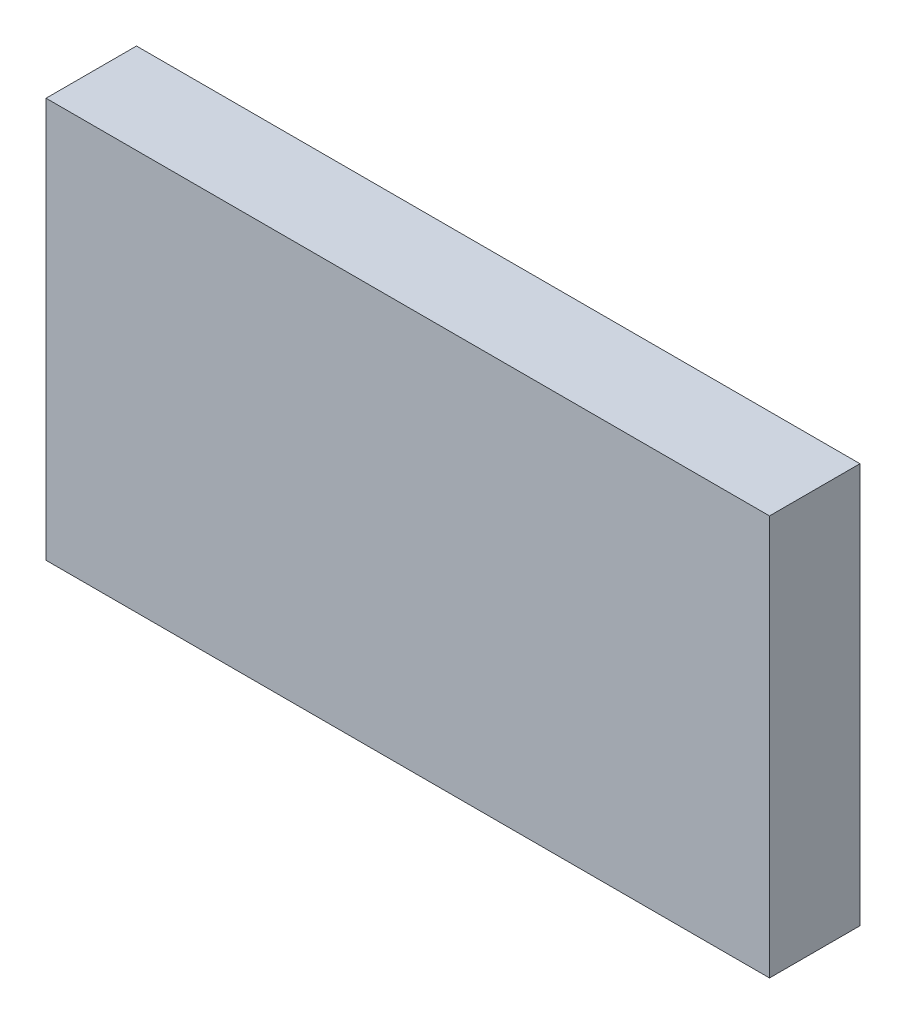
ISO-10303-21;
HEADER;
FILE_DESCRIPTION(('STEP AP214'),'2;1');
FILE_NAME('part.step','',(''),(''),'','','');
FILE_SCHEMA(('AUTOMOTIVE_DESIGN { 1 0 10303 214 1 1 1 1 }'));
ENDSEC;
DATA;
#1=APPLICATION_CONTEXT('core data for automotive mechanical design processes');
#2=APPLICATION_PROTOCOL_DEFINITION('international standard','automotive_design',2000,#1);
#3=PRODUCT_CONTEXT('',#1,'mechanical');
#4=PRODUCT('Part','Part','',(#3));
#5=PRODUCT_RELATED_PRODUCT_CATEGORY('part','',(#4));
#6=PRODUCT_DEFINITION_FORMATION('','',#4);
#7=PRODUCT_DEFINITION_CONTEXT('part definition',#1,'design');
#8=PRODUCT_DEFINITION('design','',#6,#7);
#9=PRODUCT_DEFINITION_SHAPE('','',#8);
#10=(LENGTH_UNIT() NAMED_UNIT(*) SI_UNIT(.MILLI.,.METRE.));
#11=(NAMED_UNIT(*) PLANE_ANGLE_UNIT() SI_UNIT($,.RADIAN.));
#12=(NAMED_UNIT(*) SI_UNIT($,.STERADIAN.) SOLID_ANGLE_UNIT());
#13=UNCERTAINTY_MEASURE_WITH_UNIT(LENGTH_MEASURE(1.E-05),#10,'distance_accuracy_value','');
#14=(GEOMETRIC_REPRESENTATION_CONTEXT(3) GLOBAL_UNCERTAINTY_ASSIGNED_CONTEXT((#13)) GLOBAL_UNIT_ASSIGNED_CONTEXT((#10,
#11,#12)) REPRESENTATION_CONTEXT('',''));
#15=CARTESIAN_POINT('',(0.,0.,0.));
#16=DIRECTION('',(0.,0.,1.));
#17=DIRECTION('',(1.,0.,0.));
#18=AXIS2_PLACEMENT_3D('',#15,#16,#17);
#19=CARTESIAN_POINT('',(-101.6,56.2,-11.3974358974359));
#20=DIRECTION('',(1.,0.,0.));
#21=DIRECTION('',(0.,0.,-1.));
#22=AXIS2_PLACEMENT_3D('',#19,#20,#21);
#23=PLANE('',#22);
#24=DIRECTION('',(0.,0.,1.));
#25=VECTOR('',#24,1.);
#26=CARTESIAN_POINT('',(-101.6,0.,-11.3974358974359));
#27=LINE('',#26,#25);
#28=CARTESIAN_POINT('',(-101.6,0.,-11.3974358974359));
#29=VERTEX_POINT('',#28);
#30=CARTESIAN_POINT('',(-101.6,0.,1.3025641025641));
#31=VERTEX_POINT('',#30);
#32=EDGE_CURVE('E96',#29,#31,#27,.T.);
#33=ORIENTED_EDGE('',*,*,#32,.T.);
#34=DIRECTION('',(0.,-1.,0.));
#35=VECTOR('',#34,1.);
#36=CARTESIAN_POINT('',(-101.6,56.2,1.3025641025641));
#37=LINE('',#36,#35);
#38=CARTESIAN_POINT('',(-101.6,56.2,1.3025641025641));
#39=VERTEX_POINT('',#38);
#40=EDGE_CURVE('E11',#39,#31,#37,.T.);
#41=ORIENTED_EDGE('',*,*,#40,.F.);
#42=DIRECTION('',(0.,0.,1.));
#43=VECTOR('',#42,1.);
#44=CARTESIAN_POINT('',(-101.6,56.2,-11.3974358974359));
#45=LINE('',#44,#43);
#46=CARTESIAN_POINT('',(-101.6,56.2,-11.3974358974359));
#47=VERTEX_POINT('',#46);
#48=EDGE_CURVE('E84',#47,#39,#45,.T.);
#49=ORIENTED_EDGE('',*,*,#48,.F.);
#50=DIRECTION('',(0.,-1.,0.));
#51=VECTOR('',#50,1.);
#52=CARTESIAN_POINT('',(-101.6,56.2,-11.3974358974359));
#53=LINE('',#52,#51);
#54=EDGE_CURVE('E92',#47,#29,#53,.T.);
#55=ORIENTED_EDGE('',*,*,#54,.T.);
#56=EDGE_LOOP('',(#33,#41,#49,#55));
#57=FACE_BOUND('',#56,.T.);
#58=ADVANCED_FACE('F33',(#57),#23,.F.);
#59=CARTESIAN_POINT('',(-101.6,56.2,1.3025641025641));
#60=DIRECTION('',(0.,0.,-1.));
#61=DIRECTION('',(-1.,0.,0.));
#62=AXIS2_PLACEMENT_3D('',#59,#60,#61);
#63=PLANE('',#62);
#64=DIRECTION('',(1.,0.,0.));
#65=VECTOR('',#64,1.);
#66=CARTESIAN_POINT('',(-101.6,0.,1.3025641025641));
#67=LINE('',#66,#65);
#68=CARTESIAN_POINT('',(0.,0.,1.3025641025641));
#69=VERTEX_POINT('',#68);
#70=EDGE_CURVE('E88',#31,#69,#67,.T.);
#71=ORIENTED_EDGE('',*,*,#70,.T.);
#72=DIRECTION('',(0.,-1.,0.));
#73=VECTOR('',#72,1.);
#74=CARTESIAN_POINT('',(0.,56.2,1.3025641025641));
#75=LINE('',#74,#73);
#76=CARTESIAN_POINT('',(0.,56.2,1.3025641025641));
#77=VERTEX_POINT('',#76);
#78=EDGE_CURVE('E41',#77,#69,#75,.T.);
#79=ORIENTED_EDGE('',*,*,#78,.F.);
#80=DIRECTION('',(1.,0.,0.));
#81=VECTOR('',#80,1.);
#82=CARTESIAN_POINT('',(-101.6,56.2,1.3025641025641));
#83=LINE('',#82,#81);
#84=EDGE_CURVE('E79',#39,#77,#83,.T.);
#85=ORIENTED_EDGE('',*,*,#84,.F.);
#86=ORIENTED_EDGE('',*,*,#40,.T.);
#87=EDGE_LOOP('',(#71,#79,#85,#86));
#88=FACE_BOUND('',#87,.T.);
#89=ADVANCED_FACE('F87',(#88),#63,.F.);
#90=CARTESIAN_POINT('',(0.,56.2,-11.3974358974359));
#91=DIRECTION('',(-1.,0.,0.));
#92=DIRECTION('',(0.,0.,1.));
#93=AXIS2_PLACEMENT_3D('',#90,#91,#92);
#94=PLANE('',#93);
#95=DIRECTION('',(0.,0.,-1.));
#96=VECTOR('',#95,1.);
#97=CARTESIAN_POINT('',(0.,0.,-11.3974358974359));
#98=LINE('',#97,#96);
#99=CARTESIAN_POINT('',(0.,0.,-11.3974358974359));
#100=VERTEX_POINT('',#99);
#101=EDGE_CURVE('E66',#69,#100,#98,.T.);
#102=ORIENTED_EDGE('',*,*,#101,.T.);
#103=DIRECTION('',(0.,-1.,0.));
#104=VECTOR('',#103,1.);
#105=CARTESIAN_POINT('',(0.,56.2,-11.3974358974359));
#106=LINE('',#105,#104);
#107=CARTESIAN_POINT('',(0.,56.2,-11.3974358974359));
#108=VERTEX_POINT('',#107);
#109=EDGE_CURVE('E89',#108,#100,#106,.T.);
#110=ORIENTED_EDGE('',*,*,#109,.F.);
#111=DIRECTION('',(0.,0.,-1.));
#112=VECTOR('',#111,1.);
#113=CARTESIAN_POINT('',(0.,56.2,-11.3974358974359));
#114=LINE('',#113,#112);
#115=EDGE_CURVE('E82',#77,#108,#114,.T.);
#116=ORIENTED_EDGE('',*,*,#115,.F.);
#117=ORIENTED_EDGE('',*,*,#78,.T.);
#118=EDGE_LOOP('',(#102,#110,#116,#117));
#119=FACE_BOUND('',#118,.T.);
#120=ADVANCED_FACE('F90',(#119),#94,.F.);
#121=CARTESIAN_POINT('',(-101.6,56.2,-11.3974358974359));
#122=DIRECTION('',(0.,0.,1.));
#123=DIRECTION('',(1.,0.,0.));
#124=AXIS2_PLACEMENT_3D('',#121,#122,#123);
#125=PLANE('',#124);
#126=DIRECTION('',(-1.,0.,0.));
#127=VECTOR('',#126,1.);
#128=CARTESIAN_POINT('',(-101.6,0.,-11.3974358974359));
#129=LINE('',#128,#127);
#130=EDGE_CURVE('E72',#100,#29,#129,.T.);
#131=ORIENTED_EDGE('',*,*,#130,.T.);
#132=ORIENTED_EDGE('',*,*,#54,.F.);
#133=DIRECTION('',(-1.,0.,0.));
#134=VECTOR('',#133,1.);
#135=CARTESIAN_POINT('',(-101.6,56.2,-11.3974358974359));
#136=LINE('',#135,#134);
#137=EDGE_CURVE('E49',#108,#47,#136,.T.);
#138=ORIENTED_EDGE('',*,*,#137,.F.);
#139=ORIENTED_EDGE('',*,*,#109,.T.);
#140=EDGE_LOOP('',(#131,#132,#138,#139));
#141=FACE_BOUND('',#140,.T.);
#142=ADVANCED_FACE('F103',(#141),#125,.F.);
#143=CARTESIAN_POINT('',(0.,56.2,0.));
#144=DIRECTION('',(0.,1.,0.));
#145=DIRECTION('',(0.,0.,1.));
#146=AXIS2_PLACEMENT_3D('',#143,#144,#145);
#147=PLANE('',#146);
#148=ORIENTED_EDGE('',*,*,#48,.T.);
#149=ORIENTED_EDGE('',*,*,#84,.T.);
#150=ORIENTED_EDGE('',*,*,#115,.T.);
#151=ORIENTED_EDGE('',*,*,#137,.T.);
#152=EDGE_LOOP('',(#148,#149,#150,#151));
#153=FACE_BOUND('',#152,.T.);
#154=ADVANCED_FACE('F80',(#153),#147,.T.);
#155=CARTESIAN_POINT('',(0.,0.,0.));
#156=DIRECTION('',(0.,1.,0.));
#157=DIRECTION('',(0.,0.,1.));
#158=AXIS2_PLACEMENT_3D('',#155,#156,#157);
#159=PLANE('',#158);
#160=ORIENTED_EDGE('',*,*,#32,.F.);
#161=ORIENTED_EDGE('',*,*,#130,.F.);
#162=ORIENTED_EDGE('',*,*,#101,.F.);
#163=ORIENTED_EDGE('',*,*,#70,.F.);
#164=EDGE_LOOP('',(#160,#161,#162,#163));
#165=FACE_BOUND('',#164,.T.);
#166=ADVANCED_FACE('F106',(#165),#159,.F.);
#167=CLOSED_SHELL('',(#58,#89,#120,#142,#154,#166));
#168=MANIFOLD_SOLID_BREP('B2',#167);
#169=ADVANCED_BREP_SHAPE_REPRESENTATION('',(#18,#168),#14);
#170=SHAPE_DEFINITION_REPRESENTATION(#9,#169);
ENDSEC;
END-ISO-10303-21;
